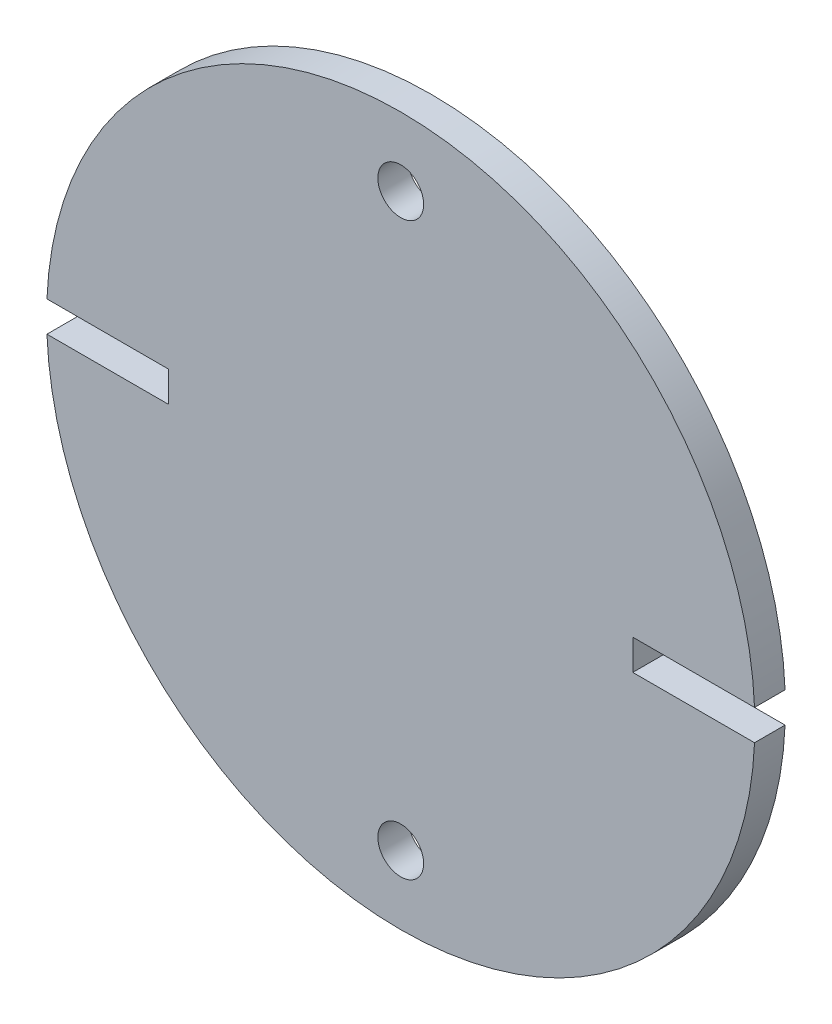
ISO-10303-21;
HEADER;
FILE_DESCRIPTION(('STEP AP214'),'2;1');
FILE_NAME('part.step','',(''),(''),'','','');
FILE_SCHEMA(('AUTOMOTIVE_DESIGN { 1 0 10303 214 1 1 1 1 }'));
ENDSEC;
DATA;
#1=APPLICATION_CONTEXT('core data for automotive mechanical design processes');
#2=APPLICATION_PROTOCOL_DEFINITION('international standard','automotive_design',2000,#1);
#3=PRODUCT_CONTEXT('',#1,'mechanical');
#4=PRODUCT('Part','Part','',(#3));
#5=PRODUCT_RELATED_PRODUCT_CATEGORY('part','',(#4));
#6=PRODUCT_DEFINITION_FORMATION('','',#4);
#7=PRODUCT_DEFINITION_CONTEXT('part definition',#1,'design');
#8=PRODUCT_DEFINITION('design','',#6,#7);
#9=PRODUCT_DEFINITION_SHAPE('','',#8);
#10=(LENGTH_UNIT() NAMED_UNIT(*) SI_UNIT(.MILLI.,.METRE.));
#11=(NAMED_UNIT(*) PLANE_ANGLE_UNIT() SI_UNIT($,.RADIAN.));
#12=(NAMED_UNIT(*) SI_UNIT($,.STERADIAN.) SOLID_ANGLE_UNIT());
#13=UNCERTAINTY_MEASURE_WITH_UNIT(LENGTH_MEASURE(1.E-05),#10,'distance_accuracy_value','');
#14=(GEOMETRIC_REPRESENTATION_CONTEXT(3) GLOBAL_UNCERTAINTY_ASSIGNED_CONTEXT((#13)) GLOBAL_UNIT_ASSIGNED_CONTEXT((#10,
#11,#12)) REPRESENTATION_CONTEXT('',''));
#15=CARTESIAN_POINT('',(0.,0.,0.));
#16=DIRECTION('',(0.,0.,1.));
#17=DIRECTION('',(1.,0.,0.));
#18=AXIS2_PLACEMENT_3D('',#15,#16,#17);
#19=CARTESIAN_POINT('',(0.,0.,6.35));
#20=DIRECTION('',(0.,0.,1.));
#21=DIRECTION('',(1.,0.,0.));
#22=AXIS2_PLACEMENT_3D('',#19,#20,#21);
#23=PLANE('',#22);
#24=CARTESIAN_POINT('',(0.,59.3725,6.35));
#25=DIRECTION('',(0.,0.,-1.));
#26=DIRECTION('',(-1.,0.,0.));
#27=AXIS2_PLACEMENT_3D('',#24,#25,#26);
#28=CIRCLE('',#27,4.7625);
#29=CARTESIAN_POINT('',(-4.7625,59.3725,6.35));
#30=VERTEX_POINT('',#29);
#31=EDGE_CURVE('E139',#30,#30,#28,.F.);
#32=ORIENTED_EDGE('',*,*,#31,.F.);
#33=EDGE_LOOP('',(#32));
#34=FACE_BOUND('',#33,.T.);
#35=DIRECTION('',(-1.,0.,0.));
#36=VECTOR('',#35,1.);
#37=CARTESIAN_POINT('',(76.2,-3.17500000000001,6.35));
#38=LINE('',#37,#36);
#39=CARTESIAN_POINT('',(73.5915414636764,-3.17500000000001,6.35));
#40=VERTEX_POINT('',#39);
#41=CARTESIAN_POINT('',(48.26,-3.17500000000001,6.35));
#42=VERTEX_POINT('',#41);
#43=EDGE_CURVE('E122',#40,#42,#38,.T.);
#44=ORIENTED_EDGE('',*,*,#43,.T.);
#45=DIRECTION('',(0.,1.,0.));
#46=VECTOR('',#45,1.);
#47=CARTESIAN_POINT('',(48.26,-3.17500000000001,6.35));
#48=LINE('',#47,#46);
#49=CARTESIAN_POINT('',(48.26,3.175,6.35));
#50=VERTEX_POINT('',#49);
#51=EDGE_CURVE('E116',#42,#50,#48,.T.);
#52=ORIENTED_EDGE('',*,*,#51,.T.);
#53=DIRECTION('',(1.,0.,0.));
#54=VECTOR('',#53,1.);
#55=CARTESIAN_POINT('',(48.26,3.175,6.35));
#56=LINE('',#55,#54);
#57=CARTESIAN_POINT('',(73.5915414636764,3.17499999999999,6.35));
#58=VERTEX_POINT('',#57);
#59=EDGE_CURVE('E125',#50,#58,#56,.T.);
#60=ORIENTED_EDGE('',*,*,#59,.T.);
#61=CARTESIAN_POINT('',(0.,0.,6.35));
#62=DIRECTION('',(0.,0.,1.));
#63=DIRECTION('',(1.,0.,0.));
#64=AXIS2_PLACEMENT_3D('',#61,#62,#63);
#65=CIRCLE('',#64,73.66);
#66=CARTESIAN_POINT('',(-73.5915414636764,3.17500000000001,6.35));
#67=VERTEX_POINT('',#66);
#68=EDGE_CURVE('E174',#58,#67,#65,.T.);
#69=ORIENTED_EDGE('',*,*,#68,.T.);
#70=DIRECTION('',(1.,0.,0.));
#71=VECTOR('',#70,1.);
#72=CARTESIAN_POINT('',(-48.26,3.17500000000001,6.35));
#73=LINE('',#72,#71);
#74=CARTESIAN_POINT('',(-48.26,3.17500000000001,6.35));
#75=VERTEX_POINT('',#74);
#76=EDGE_CURVE('E160',#67,#75,#73,.T.);
#77=ORIENTED_EDGE('',*,*,#76,.T.);
#78=DIRECTION('',(0.,-1.,0.));
#79=VECTOR('',#78,1.);
#80=CARTESIAN_POINT('',(-48.26,0.,6.35));
#81=LINE('',#80,#79);
#82=CARTESIAN_POINT('',(-48.26,-3.175,6.35));
#83=VERTEX_POINT('',#82);
#84=EDGE_CURVE('E149',#75,#83,#81,.T.);
#85=ORIENTED_EDGE('',*,*,#84,.T.);
#86=DIRECTION('',(-1.,0.,0.));
#87=VECTOR('',#86,1.);
#88=CARTESIAN_POINT('',(-76.2,-3.17499999999999,6.35));
#89=LINE('',#88,#87);
#90=CARTESIAN_POINT('',(-73.5915414636764,-3.17499999999999,6.35));
#91=VERTEX_POINT('',#90);
#92=EDGE_CURVE('E156',#83,#91,#89,.T.);
#93=ORIENTED_EDGE('',*,*,#92,.T.);
#94=EDGE_CURVE('E176',#91,#40,#65,.T.);
#95=ORIENTED_EDGE('',*,*,#94,.T.);
#96=EDGE_LOOP('',(#44,#52,#60,#69,#77,#85,#93,#95));
#97=FACE_BOUND('',#96,.T.);
#98=CARTESIAN_POINT('',(0.,-59.3725,6.35));
#99=DIRECTION('',(0.,0.,-1.));
#100=DIRECTION('',(-1.,0.,0.));
#101=AXIS2_PLACEMENT_3D('',#98,#99,#100);
#102=CIRCLE('',#101,4.7625);
#103=CARTESIAN_POINT('',(-4.7625,-59.3725,6.35));
#104=VERTEX_POINT('',#103);
#105=EDGE_CURVE('E152',#104,#104,#102,.T.);
#106=ORIENTED_EDGE('',*,*,#105,.T.);
#107=EDGE_LOOP('',(#106));
#108=FACE_BOUND('',#107,.T.);
#109=ADVANCED_FACE('F49',(#34,#97,#108),#23,.T.);
#110=CARTESIAN_POINT('',(0.,0.,0.));
#111=DIRECTION('',(0.,0.,1.));
#112=DIRECTION('',(1.,0.,0.));
#113=AXIS2_PLACEMENT_3D('',#110,#111,#112);
#114=PLANE('',#113);
#115=DIRECTION('',(0.,1.,0.));
#116=VECTOR('',#115,1.);
#117=CARTESIAN_POINT('',(48.26,0.,0.));
#118=LINE('',#117,#116);
#119=CARTESIAN_POINT('',(48.26,-3.17500000000001,0.));
#120=VERTEX_POINT('',#119);
#121=CARTESIAN_POINT('',(48.26,3.175,0.));
#122=VERTEX_POINT('',#121);
#123=EDGE_CURVE('E119',#120,#122,#118,.T.);
#124=ORIENTED_EDGE('',*,*,#123,.F.);
#125=DIRECTION('',(1.,0.,0.));
#126=VECTOR('',#125,1.);
#127=CARTESIAN_POINT('',(0.,-3.17500000000001,0.));
#128=LINE('',#127,#126);
#129=CARTESIAN_POINT('',(73.5915414636764,-3.17500000000001,0.));
#130=VERTEX_POINT('',#129);
#131=EDGE_CURVE('E12',#120,#130,#128,.T.);
#132=ORIENTED_EDGE('',*,*,#131,.T.);
#133=CARTESIAN_POINT('',(0.,0.,0.));
#134=DIRECTION('',(0.,0.,1.));
#135=DIRECTION('',(1.,0.,0.));
#136=AXIS2_PLACEMENT_3D('',#133,#134,#135);
#137=CIRCLE('',#136,73.66);
#138=CARTESIAN_POINT('',(-73.5915414636764,-3.17499999999999,0.));
#139=VERTEX_POINT('',#138);
#140=EDGE_CURVE('E173',#139,#130,#137,.T.);
#141=ORIENTED_EDGE('',*,*,#140,.F.);
#142=DIRECTION('',(-1.,0.,0.));
#143=VECTOR('',#142,1.);
#144=CARTESIAN_POINT('',(-76.2,-3.17499999999999,0.));
#145=LINE('',#144,#143);
#146=CARTESIAN_POINT('',(-48.26,-3.175,0.));
#147=VERTEX_POINT('',#146);
#148=EDGE_CURVE('E143',#147,#139,#145,.T.);
#149=ORIENTED_EDGE('',*,*,#148,.F.);
#150=DIRECTION('',(0.,-1.,0.));
#151=VECTOR('',#150,1.);
#152=CARTESIAN_POINT('',(-48.26,-3.175,0.));
#153=LINE('',#152,#151);
#154=CARTESIAN_POINT('',(-48.26,3.17500000000001,0.));
#155=VERTEX_POINT('',#154);
#156=EDGE_CURVE('E153',#155,#147,#153,.T.);
#157=ORIENTED_EDGE('',*,*,#156,.F.);
#158=DIRECTION('',(-1.,0.,0.));
#159=VECTOR('',#158,1.);
#160=CARTESIAN_POINT('',(0.,3.175,0.));
#161=LINE('',#160,#159);
#162=CARTESIAN_POINT('',(-73.5915414636764,3.17500000000001,0.));
#163=VERTEX_POINT('',#162);
#164=EDGE_CURVE('E57',#155,#163,#161,.T.);
#165=ORIENTED_EDGE('',*,*,#164,.T.);
#166=CARTESIAN_POINT('',(73.5915414636764,3.17499999999999,0.));
#167=VERTEX_POINT('',#166);
#168=EDGE_CURVE('E177',#167,#163,#137,.T.);
#169=ORIENTED_EDGE('',*,*,#168,.F.);
#170=DIRECTION('',(1.,0.,0.));
#171=VECTOR('',#170,1.);
#172=CARTESIAN_POINT('',(48.26,3.175,0.));
#173=LINE('',#172,#171);
#174=EDGE_CURVE('E135',#122,#167,#173,.T.);
#175=ORIENTED_EDGE('',*,*,#174,.F.);
#176=EDGE_LOOP('',(#124,#132,#141,#149,#157,#165,#169,#175));
#177=FACE_BOUND('',#176,.T.);
#178=CARTESIAN_POINT('',(0.,59.3725,0.));
#179=DIRECTION('',(0.,0.,-1.));
#180=DIRECTION('',(-1.,0.,0.));
#181=AXIS2_PLACEMENT_3D('',#178,#179,#180);
#182=CIRCLE('',#181,4.7625);
#183=CARTESIAN_POINT('',(-4.7625,59.3725,0.));
#184=VERTEX_POINT('',#183);
#185=EDGE_CURVE('E237',#184,#184,#182,.F.);
#186=ORIENTED_EDGE('',*,*,#185,.T.);
#187=EDGE_LOOP('',(#186));
#188=FACE_BOUND('',#187,.T.);
#189=CARTESIAN_POINT('',(0.,-59.3725,0.));
#190=DIRECTION('',(0.,0.,-1.));
#191=DIRECTION('',(-1.,0.,0.));
#192=AXIS2_PLACEMENT_3D('',#189,#190,#191);
#193=CIRCLE('',#192,4.7625);
#194=CARTESIAN_POINT('',(-4.7625,-59.3725,0.));
#195=VERTEX_POINT('',#194);
#196=EDGE_CURVE('E238',#195,#195,#193,.T.);
#197=ORIENTED_EDGE('',*,*,#196,.F.);
#198=EDGE_LOOP('',(#197));
#199=FACE_BOUND('',#198,.T.);
#200=ADVANCED_FACE('F182',(#177,#188,#199),#114,.F.);
#201=CARTESIAN_POINT('',(0.,0.,6.35));
#202=DIRECTION('',(0.,0.,-1.));
#203=DIRECTION('',(-1.,0.,0.));
#204=AXIS2_PLACEMENT_3D('',#201,#202,#203);
#205=CYLINDRICAL_SURFACE('',#204,73.66);
#206=ORIENTED_EDGE('',*,*,#140,.T.);
#207=DIRECTION('',(0.,0.,-1.));
#208=VECTOR('',#207,1.);
#209=CARTESIAN_POINT('',(73.5915414636764,-3.17500000000001,6.35));
#210=LINE('',#209,#208);
#211=EDGE_CURVE('E170',#130,#40,#210,.F.);
#212=ORIENTED_EDGE('',*,*,#211,.T.);
#213=ORIENTED_EDGE('',*,*,#94,.F.);
#214=DIRECTION('',(0.,0.,-1.));
#215=VECTOR('',#214,1.);
#216=CARTESIAN_POINT('',(-73.5915414636764,-3.17499999999999,6.35));
#217=LINE('',#216,#215);
#218=EDGE_CURVE('E166',#91,#139,#217,.T.);
#219=ORIENTED_EDGE('',*,*,#218,.T.);
#220=EDGE_LOOP('',(#206,#212,#213,#219));
#221=FACE_BOUND('',#220,.T.);
#222=ADVANCED_FACE('F196',(#221),#205,.T.);
#223=ORIENTED_EDGE('',*,*,#68,.F.);
#224=DIRECTION('',(0.,0.,-1.));
#225=VECTOR('',#224,1.);
#226=CARTESIAN_POINT('',(73.5915414636764,3.17499999999999,6.35));
#227=LINE('',#226,#225);
#228=EDGE_CURVE('E128',#58,#167,#227,.T.);
#229=ORIENTED_EDGE('',*,*,#228,.T.);
#230=ORIENTED_EDGE('',*,*,#168,.T.);
#231=DIRECTION('',(0.,0.,-1.));
#232=VECTOR('',#231,1.);
#233=CARTESIAN_POINT('',(-73.5915414636764,3.17500000000001,6.35));
#234=LINE('',#233,#232);
#235=EDGE_CURVE('E72',#163,#67,#234,.F.);
#236=ORIENTED_EDGE('',*,*,#235,.T.);
#237=EDGE_LOOP('',(#223,#229,#230,#236));
#238=FACE_BOUND('',#237,.T.);
#239=ADVANCED_FACE('F51',(#238),#205,.T.);
#240=CARTESIAN_POINT('',(-76.2,-3.17499999999999,6.35));
#241=DIRECTION('',(0.,-1.,0.));
#242=DIRECTION('',(1.,0.,0.));
#243=AXIS2_PLACEMENT_3D('',#240,#241,#242);
#244=PLANE('',#243);
#245=ORIENTED_EDGE('',*,*,#92,.F.);
#246=DIRECTION('',(0.,0.,-1.));
#247=VECTOR('',#246,1.);
#248=CARTESIAN_POINT('',(-48.26,-3.175,6.35));
#249=LINE('',#248,#247);
#250=EDGE_CURVE('E150',#83,#147,#249,.T.);
#251=ORIENTED_EDGE('',*,*,#250,.T.);
#252=ORIENTED_EDGE('',*,*,#148,.T.);
#253=ORIENTED_EDGE('',*,*,#218,.F.);
#254=EDGE_LOOP('',(#245,#251,#252,#253));
#255=FACE_BOUND('',#254,.T.);
#256=ADVANCED_FACE('F192',(#255),#244,.F.);
#257=CARTESIAN_POINT('',(-48.26,3.17500000000001,6.35));
#258=DIRECTION('',(0.,1.,0.));
#259=DIRECTION('',(-1.,0.,0.));
#260=AXIS2_PLACEMENT_3D('',#257,#258,#259);
#261=PLANE('',#260);
#262=ORIENTED_EDGE('',*,*,#164,.F.);
#263=DIRECTION('',(0.,0.,-1.));
#264=VECTOR('',#263,1.);
#265=CARTESIAN_POINT('',(-48.26,3.17500000000001,6.35));
#266=LINE('',#265,#264);
#267=EDGE_CURVE('E146',#75,#155,#266,.T.);
#268=ORIENTED_EDGE('',*,*,#267,.F.);
#269=ORIENTED_EDGE('',*,*,#76,.F.);
#270=ORIENTED_EDGE('',*,*,#235,.F.);
#271=EDGE_LOOP('',(#262,#268,#269,#270));
#272=FACE_BOUND('',#271,.T.);
#273=ADVANCED_FACE('F187',(#272),#261,.F.);
#274=CARTESIAN_POINT('',(-48.26,-3.175,6.35));
#275=DIRECTION('',(1.,0.,0.));
#276=DIRECTION('',(0.,0.,-1.));
#277=AXIS2_PLACEMENT_3D('',#274,#275,#276);
#278=PLANE('',#277);
#279=ORIENTED_EDGE('',*,*,#156,.T.);
#280=ORIENTED_EDGE('',*,*,#250,.F.);
#281=ORIENTED_EDGE('',*,*,#84,.F.);
#282=ORIENTED_EDGE('',*,*,#267,.T.);
#283=EDGE_LOOP('',(#279,#280,#281,#282));
#284=FACE_BOUND('',#283,.T.);
#285=ADVANCED_FACE('F189',(#284),#278,.F.);
#286=CARTESIAN_POINT('',(76.2,-3.17500000000001,6.35));
#287=DIRECTION('',(0.,-1.,0.));
#288=DIRECTION('',(0.,0.,-1.));
#289=AXIS2_PLACEMENT_3D('',#286,#287,#288);
#290=PLANE('',#289);
#291=ORIENTED_EDGE('',*,*,#131,.F.);
#292=DIRECTION('',(0.,0.,-1.));
#293=VECTOR('',#292,1.);
#294=CARTESIAN_POINT('',(48.26,-3.17500000000001,6.35));
#295=LINE('',#294,#293);
#296=EDGE_CURVE('E64',#42,#120,#295,.T.);
#297=ORIENTED_EDGE('',*,*,#296,.F.);
#298=ORIENTED_EDGE('',*,*,#43,.F.);
#299=ORIENTED_EDGE('',*,*,#211,.F.);
#300=EDGE_LOOP('',(#291,#297,#298,#299));
#301=FACE_BOUND('',#300,.T.);
#302=ADVANCED_FACE('F199',(#301),#290,.F.);
#303=CARTESIAN_POINT('',(48.26,3.175,6.35));
#304=DIRECTION('',(0.,1.,0.));
#305=DIRECTION('',(-1.,0.,0.));
#306=AXIS2_PLACEMENT_3D('',#303,#304,#305);
#307=PLANE('',#306);
#308=ORIENTED_EDGE('',*,*,#59,.F.);
#309=DIRECTION('',(0.,0.,-1.));
#310=VECTOR('',#309,1.);
#311=CARTESIAN_POINT('',(48.26,3.175,6.35));
#312=LINE('',#311,#310);
#313=EDGE_CURVE('E112',#50,#122,#312,.T.);
#314=ORIENTED_EDGE('',*,*,#313,.T.);
#315=ORIENTED_EDGE('',*,*,#174,.T.);
#316=ORIENTED_EDGE('',*,*,#228,.F.);
#317=EDGE_LOOP('',(#308,#314,#315,#316));
#318=FACE_BOUND('',#317,.T.);
#319=ADVANCED_FACE('F126',(#318),#307,.F.);
#320=CARTESIAN_POINT('',(48.26,0.,6.35));
#321=DIRECTION('',(-1.,0.,0.));
#322=DIRECTION('',(0.,0.,1.));
#323=AXIS2_PLACEMENT_3D('',#320,#321,#322);
#324=PLANE('',#323);
#325=ORIENTED_EDGE('',*,*,#123,.T.);
#326=ORIENTED_EDGE('',*,*,#313,.F.);
#327=ORIENTED_EDGE('',*,*,#51,.F.);
#328=ORIENTED_EDGE('',*,*,#296,.T.);
#329=EDGE_LOOP('',(#325,#326,#327,#328));
#330=FACE_BOUND('',#329,.T.);
#331=ADVANCED_FACE('F114',(#330),#324,.F.);
#332=CARTESIAN_POINT('',(0.,59.3725,6.35));
#333=DIRECTION('',(0.,0.,-1.));
#334=DIRECTION('',(-1.,0.,0.));
#335=AXIS2_PLACEMENT_3D('',#332,#333,#334);
#336=CYLINDRICAL_SURFACE('',#335,4.7625);
#337=ORIENTED_EDGE('',*,*,#31,.T.);
#338=EDGE_LOOP('',(#337));
#339=FACE_BOUND('',#338,.T.);
#340=ORIENTED_EDGE('',*,*,#185,.F.);
#341=EDGE_LOOP('',(#340));
#342=FACE_BOUND('',#341,.T.);
#343=ADVANCED_FACE('F222',(#339,#342),#336,.F.);
#344=CARTESIAN_POINT('',(0.,-59.3725,6.35));
#345=DIRECTION('',(0.,0.,-1.));
#346=DIRECTION('',(-1.,0.,0.));
#347=AXIS2_PLACEMENT_3D('',#344,#345,#346);
#348=CYLINDRICAL_SURFACE('',#347,4.7625);
#349=ORIENTED_EDGE('',*,*,#105,.F.);
#350=EDGE_LOOP('',(#349));
#351=FACE_BOUND('',#350,.T.);
#352=ORIENTED_EDGE('',*,*,#196,.T.);
#353=EDGE_LOOP('',(#352));
#354=FACE_BOUND('',#353,.T.);
#355=ADVANCED_FACE('F226',(#351,#354),#348,.F.);
#356=CLOSED_SHELL('',(#109,#200,#222,#239,#256,#273,#285,#302,#319,#331,#343,#355));
#357=MANIFOLD_SOLID_BREP('B2',#356);
#358=ADVANCED_BREP_SHAPE_REPRESENTATION('',(#18,#357),#14);
#359=SHAPE_DEFINITION_REPRESENTATION(#9,#358);
ENDSEC;
END-ISO-10303-21;
